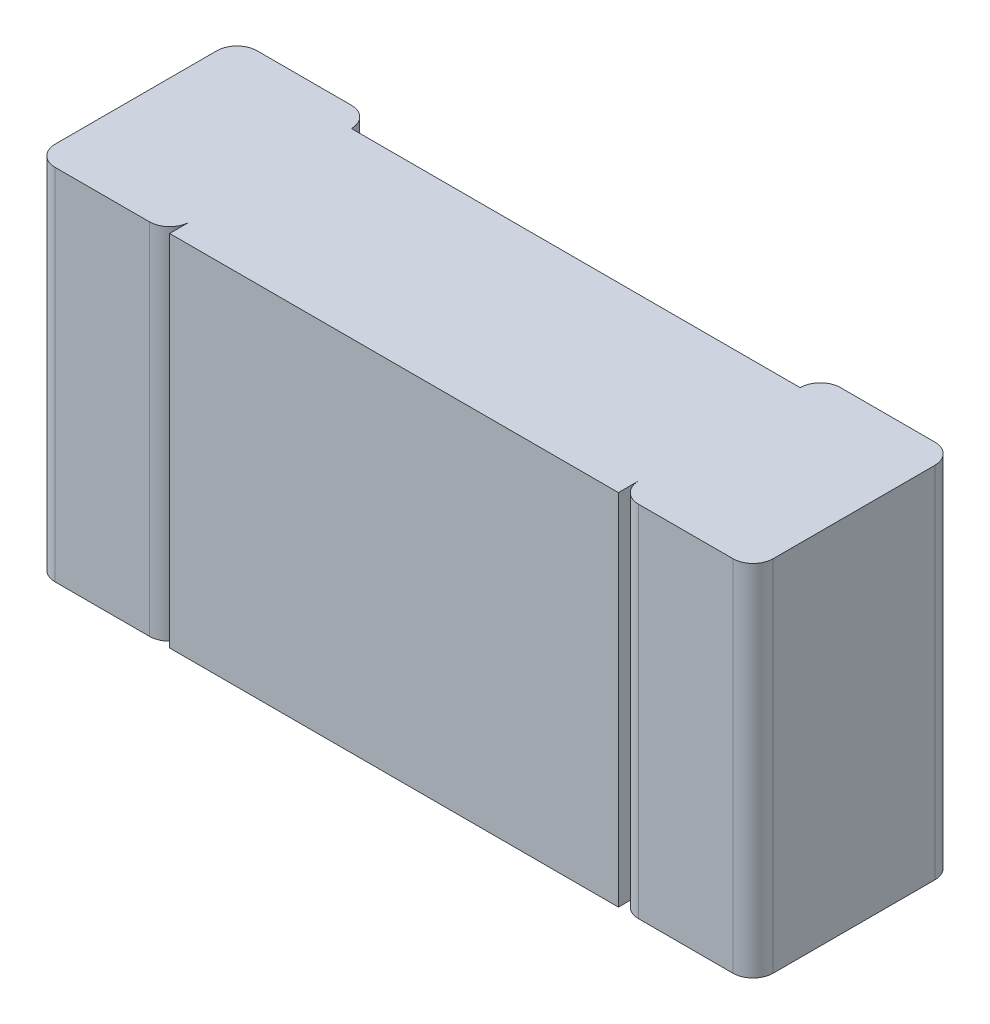
ISO-10303-21;
HEADER;
FILE_DESCRIPTION(('STEP AP214'),'2;1');
FILE_NAME('part.step','',(''),(''),'','','');
FILE_SCHEMA(('AUTOMOTIVE_DESIGN { 1 0 10303 214 1 1 1 1 }'));
ENDSEC;
DATA;
#1=APPLICATION_CONTEXT('core data for automotive mechanical design processes');
#2=APPLICATION_PROTOCOL_DEFINITION('international standard','automotive_design',2000,#1);
#3=PRODUCT_CONTEXT('',#1,'mechanical');
#4=PRODUCT('Part','Part','',(#3));
#5=PRODUCT_RELATED_PRODUCT_CATEGORY('part','',(#4));
#6=PRODUCT_DEFINITION_FORMATION('','',#4);
#7=PRODUCT_DEFINITION_CONTEXT('part definition',#1,'design');
#8=PRODUCT_DEFINITION('design','',#6,#7);
#9=PRODUCT_DEFINITION_SHAPE('','',#8);
#10=(LENGTH_UNIT() NAMED_UNIT(*) SI_UNIT(.MILLI.,.METRE.));
#11=(NAMED_UNIT(*) PLANE_ANGLE_UNIT() SI_UNIT($,.RADIAN.));
#12=(NAMED_UNIT(*) SI_UNIT($,.STERADIAN.) SOLID_ANGLE_UNIT());
#13=UNCERTAINTY_MEASURE_WITH_UNIT(LENGTH_MEASURE(1.E-05),#10,'distance_accuracy_value','');
#14=(GEOMETRIC_REPRESENTATION_CONTEXT(3) GLOBAL_UNCERTAINTY_ASSIGNED_CONTEXT((#13)) GLOBAL_UNIT_ASSIGNED_CONTEXT((#10,
#11,#12)) REPRESENTATION_CONTEXT('',''));
#15=CARTESIAN_POINT('',(0.,0.,0.));
#16=DIRECTION('',(0.,0.,1.));
#17=DIRECTION('',(1.,0.,0.));
#18=AXIS2_PLACEMENT_3D('',#15,#16,#17);
#19=CARTESIAN_POINT('',(-0.755,-0.4,0.045));
#20=DIRECTION('',(0.,1.,0.));
#21=DIRECTION('',(0.,0.,1.));
#22=AXIS2_PLACEMENT_3D('',#19,#20,#21);
#23=CYLINDRICAL_SURFACE('',#22,0.045);
#24=DIRECTION('',(0.,1.,0.));
#25=VECTOR('',#24,1.);
#26=CARTESIAN_POINT('',(-0.755,-0.4,0.));
#27=LINE('',#26,#25);
#28=CARTESIAN_POINT('',(-0.755,0.4,0.));
#29=VERTEX_POINT('',#28);
#30=CARTESIAN_POINT('',(-0.755,-0.4,0.));
#31=VERTEX_POINT('',#30);
#32=EDGE_CURVE('E129',#29,#31,#27,.F.);
#33=ORIENTED_EDGE('',*,*,#32,.T.);
#34=CARTESIAN_POINT('',(-0.755,-0.4,0.045));
#35=DIRECTION('',(0.,1.,0.));
#36=DIRECTION('',(0.,0.,1.));
#37=AXIS2_PLACEMENT_3D('',#34,#35,#36);
#38=CIRCLE('',#37,0.045);
#39=CARTESIAN_POINT('',(-0.8,-0.4,0.045));
#40=VERTEX_POINT('',#39);
#41=EDGE_CURVE('E20',#31,#40,#38,.T.);
#42=ORIENTED_EDGE('',*,*,#41,.T.);
#43=DIRECTION('',(0.,1.,0.));
#44=VECTOR('',#43,1.);
#45=CARTESIAN_POINT('',(-0.8,-0.4,0.045));
#46=LINE('',#45,#44);
#47=CARTESIAN_POINT('',(-0.8,0.4,0.045));
#48=VERTEX_POINT('',#47);
#49=EDGE_CURVE('E136',#40,#48,#46,.T.);
#50=ORIENTED_EDGE('',*,*,#49,.T.);
#51=CARTESIAN_POINT('',(-0.755,0.4,0.045));
#52=DIRECTION('',(0.,1.,0.));
#53=DIRECTION('',(0.,0.,1.));
#54=AXIS2_PLACEMENT_3D('',#51,#52,#53);
#55=CIRCLE('',#54,0.045);
#56=EDGE_CURVE('E232',#29,#48,#55,.T.);
#57=ORIENTED_EDGE('',*,*,#56,.F.);
#58=EDGE_LOOP('',(#33,#42,#50,#57));
#59=FACE_BOUND('',#58,.T.);
#60=ADVANCED_FACE('F17',(#59),#23,.T.);
#61=CARTESIAN_POINT('',(-0.8,-0.4,0.));
#62=DIRECTION('',(1.,0.,0.));
#63=DIRECTION('',(0.,0.,-1.));
#64=AXIS2_PLACEMENT_3D('',#61,#62,#63);
#65=PLANE('',#64);
#66=DIRECTION('',(0.,0.,1.));
#67=VECTOR('',#66,1.);
#68=CARTESIAN_POINT('',(-0.8,0.4,0.));
#69=LINE('',#68,#67);
#70=CARTESIAN_POINT('',(-0.8,0.4,0.405));
#71=VERTEX_POINT('',#70);
#72=EDGE_CURVE('E141',#48,#71,#69,.T.);
#73=ORIENTED_EDGE('',*,*,#72,.F.);
#74=ORIENTED_EDGE('',*,*,#49,.F.);
#75=DIRECTION('',(0.,0.,1.));
#76=VECTOR('',#75,1.);
#77=CARTESIAN_POINT('',(-0.8,-0.4,0.));
#78=LINE('',#77,#76);
#79=CARTESIAN_POINT('',(-0.8,-0.4,0.405));
#80=VERTEX_POINT('',#79);
#81=EDGE_CURVE('E140',#40,#80,#78,.T.);
#82=ORIENTED_EDGE('',*,*,#81,.T.);
#83=DIRECTION('',(0.,1.,0.));
#84=VECTOR('',#83,1.);
#85=CARTESIAN_POINT('',(-0.8,-0.4,0.405));
#86=LINE('',#85,#84);
#87=EDGE_CURVE('E142',#71,#80,#86,.F.);
#88=ORIENTED_EDGE('',*,*,#87,.F.);
#89=EDGE_LOOP('',(#73,#74,#82,#88));
#90=FACE_BOUND('',#89,.T.);
#91=ADVANCED_FACE('F138',(#90),#65,.F.);
#92=CARTESIAN_POINT('',(-0.755,-0.4,0.405));
#93=DIRECTION('',(0.,1.,0.));
#94=DIRECTION('',(0.,0.,1.));
#95=AXIS2_PLACEMENT_3D('',#92,#93,#94);
#96=CYLINDRICAL_SURFACE('',#95,0.045);
#97=CARTESIAN_POINT('',(-0.755,0.4,0.405));
#98=DIRECTION('',(0.,1.,0.));
#99=DIRECTION('',(0.,0.,1.));
#100=AXIS2_PLACEMENT_3D('',#97,#98,#99);
#101=CIRCLE('',#100,0.045);
#102=CARTESIAN_POINT('',(-0.755,0.4,0.45));
#103=VERTEX_POINT('',#102);
#104=EDGE_CURVE('E230',#71,#103,#101,.T.);
#105=ORIENTED_EDGE('',*,*,#104,.F.);
#106=ORIENTED_EDGE('',*,*,#87,.T.);
#107=CARTESIAN_POINT('',(-0.755,-0.4,0.405));
#108=DIRECTION('',(0.,1.,0.));
#109=DIRECTION('',(0.,0.,1.));
#110=AXIS2_PLACEMENT_3D('',#107,#108,#109);
#111=CIRCLE('',#110,0.045);
#112=CARTESIAN_POINT('',(-0.755,-0.4,0.45));
#113=VERTEX_POINT('',#112);
#114=EDGE_CURVE('E151',#80,#113,#111,.T.);
#115=ORIENTED_EDGE('',*,*,#114,.T.);
#116=DIRECTION('',(0.,1.,0.));
#117=VECTOR('',#116,1.);
#118=CARTESIAN_POINT('',(-0.755,-0.4,0.45));
#119=LINE('',#118,#117);
#120=EDGE_CURVE('E200',#103,#113,#119,.F.);
#121=ORIENTED_EDGE('',*,*,#120,.F.);
#122=EDGE_LOOP('',(#105,#106,#115,#121));
#123=FACE_BOUND('',#122,.T.);
#124=ADVANCED_FACE('F456',(#123),#96,.T.);
#125=CARTESIAN_POINT('',(-0.8,-0.4,0.45));
#126=DIRECTION('',(0.,0.,1.));
#127=DIRECTION('',(1.,0.,0.));
#128=AXIS2_PLACEMENT_3D('',#125,#126,#127);
#129=PLANE('',#128);
#130=DIRECTION('',(1.,0.,0.));
#131=VECTOR('',#130,1.);
#132=CARTESIAN_POINT('',(-0.8,-0.4,0.45));
#133=LINE('',#132,#131);
#134=CARTESIAN_POINT('',(-0.545,-0.4,0.45));
#135=VERTEX_POINT('',#134);
#136=EDGE_CURVE('E248',#113,#135,#133,.T.);
#137=ORIENTED_EDGE('',*,*,#136,.T.);
#138=DIRECTION('',(0.,1.,0.));
#139=VECTOR('',#138,1.);
#140=CARTESIAN_POINT('',(-0.545,-0.4,0.45));
#141=LINE('',#140,#139);
#142=CARTESIAN_POINT('',(-0.545,0.4,0.45));
#143=VERTEX_POINT('',#142);
#144=EDGE_CURVE('E198',#143,#135,#141,.F.);
#145=ORIENTED_EDGE('',*,*,#144,.F.);
#146=DIRECTION('',(1.,0.,0.));
#147=VECTOR('',#146,1.);
#148=CARTESIAN_POINT('',(-0.8,0.4,0.45));
#149=LINE('',#148,#147);
#150=EDGE_CURVE('E229',#103,#143,#149,.T.);
#151=ORIENTED_EDGE('',*,*,#150,.F.);
#152=ORIENTED_EDGE('',*,*,#120,.T.);
#153=EDGE_LOOP('',(#137,#145,#151,#152));
#154=FACE_BOUND('',#153,.T.);
#155=ADVANCED_FACE('F446',(#154),#129,.T.);
#156=CARTESIAN_POINT('',(-0.545,-0.4,0.405));
#157=DIRECTION('',(0.,1.,0.));
#158=DIRECTION('',(0.,0.,1.));
#159=AXIS2_PLACEMENT_3D('',#156,#157,#158);
#160=CYLINDRICAL_SURFACE('',#159,0.045);
#161=ORIENTED_EDGE('',*,*,#144,.T.);
#162=CARTESIAN_POINT('',(-0.545,-0.4,0.405));
#163=DIRECTION('',(0.,1.,0.));
#164=DIRECTION('',(0.,0.,1.));
#165=AXIS2_PLACEMENT_3D('',#162,#163,#164);
#166=CIRCLE('',#165,0.045);
#167=CARTESIAN_POINT('',(-0.5,-0.4,0.405));
#168=VERTEX_POINT('',#167);
#169=EDGE_CURVE('E246',#135,#168,#166,.T.);
#170=ORIENTED_EDGE('',*,*,#169,.T.);
#171=DIRECTION('',(0.,1.,0.));
#172=VECTOR('',#171,1.);
#173=CARTESIAN_POINT('',(-0.5,-0.4,0.405));
#174=LINE('',#173,#172);
#175=CARTESIAN_POINT('',(-0.5,0.4,0.405));
#176=VERTEX_POINT('',#175);
#177=EDGE_CURVE('E193',#168,#176,#174,.T.);
#178=ORIENTED_EDGE('',*,*,#177,.T.);
#179=CARTESIAN_POINT('',(-0.545,0.4,0.405));
#180=DIRECTION('',(0.,1.,0.));
#181=DIRECTION('',(0.,0.,1.));
#182=AXIS2_PLACEMENT_3D('',#179,#180,#181);
#183=CIRCLE('',#182,0.045);
#184=EDGE_CURVE('E227',#143,#176,#183,.T.);
#185=ORIENTED_EDGE('',*,*,#184,.F.);
#186=EDGE_LOOP('',(#161,#170,#178,#185));
#187=FACE_BOUND('',#186,.T.);
#188=ADVANCED_FACE('F434',(#187),#160,.T.);
#189=CARTESIAN_POINT('',(-0.5,-0.4,0.405));
#190=DIRECTION('',(1.,0.,0.));
#191=DIRECTION('',(0.,0.,-1.));
#192=AXIS2_PLACEMENT_3D('',#189,#190,#191);
#193=PLANE('',#192);
#194=DIRECTION('',(0.,0.,1.));
#195=VECTOR('',#194,1.);
#196=CARTESIAN_POINT('',(-0.5,0.4,0.405));
#197=LINE('',#196,#195);
#198=CARTESIAN_POINT('',(-0.5,0.4,0.45));
#199=VERTEX_POINT('',#198);
#200=EDGE_CURVE('E188',#176,#199,#197,.T.);
#201=ORIENTED_EDGE('',*,*,#200,.F.);
#202=ORIENTED_EDGE('',*,*,#177,.F.);
#203=DIRECTION('',(0.,0.,1.));
#204=VECTOR('',#203,1.);
#205=CARTESIAN_POINT('',(-0.5,-0.4,0.405));
#206=LINE('',#205,#204);
#207=CARTESIAN_POINT('',(-0.5,-0.4,0.45));
#208=VERTEX_POINT('',#207);
#209=EDGE_CURVE('E206',#168,#208,#206,.T.);
#210=ORIENTED_EDGE('',*,*,#209,.T.);
#211=DIRECTION('',(0.,1.,0.));
#212=VECTOR('',#211,1.);
#213=CARTESIAN_POINT('',(-0.5,-0.4,0.45));
#214=LINE('',#213,#212);
#215=EDGE_CURVE('E181',#199,#208,#214,.F.);
#216=ORIENTED_EDGE('',*,*,#215,.F.);
#217=EDGE_LOOP('',(#201,#202,#210,#216));
#218=FACE_BOUND('',#217,.T.);
#219=ADVANCED_FACE('F424',(#218),#193,.F.);
#220=CARTESIAN_POINT('',(-0.5,-0.4,0.45));
#221=DIRECTION('',(0.,0.,1.));
#222=DIRECTION('',(1.,0.,0.));
#223=AXIS2_PLACEMENT_3D('',#220,#221,#222);
#224=PLANE('',#223);
#225=DIRECTION('',(0.,1.,0.));
#226=VECTOR('',#225,1.);
#227=CARTESIAN_POINT('',(0.5,-0.4,0.45));
#228=LINE('',#227,#226);
#229=CARTESIAN_POINT('',(0.5,0.4,0.45));
#230=VERTEX_POINT('',#229);
#231=CARTESIAN_POINT('',(0.5,-0.4,0.45));
#232=VERTEX_POINT('',#231);
#233=EDGE_CURVE('E174',#230,#232,#228,.F.);
#234=ORIENTED_EDGE('',*,*,#233,.F.);
#235=DIRECTION('',(1.,0.,0.));
#236=VECTOR('',#235,1.);
#237=CARTESIAN_POINT('',(-0.5,0.4,0.45));
#238=LINE('',#237,#236);
#239=EDGE_CURVE('E184',#199,#230,#238,.T.);
#240=ORIENTED_EDGE('',*,*,#239,.F.);
#241=ORIENTED_EDGE('',*,*,#215,.T.);
#242=DIRECTION('',(1.,0.,0.));
#243=VECTOR('',#242,1.);
#244=CARTESIAN_POINT('',(-0.5,-0.4,0.45));
#245=LINE('',#244,#243);
#246=EDGE_CURVE('E203',#208,#232,#245,.T.);
#247=ORIENTED_EDGE('',*,*,#246,.T.);
#248=EDGE_LOOP('',(#234,#240,#241,#247));
#249=FACE_BOUND('',#248,.T.);
#250=ADVANCED_FACE('F411',(#249),#224,.T.);
#251=CARTESIAN_POINT('',(0.5,-0.4,0.405));
#252=DIRECTION('',(1.,0.,0.));
#253=DIRECTION('',(0.,0.,-1.));
#254=AXIS2_PLACEMENT_3D('',#251,#252,#253);
#255=PLANE('',#254);
#256=DIRECTION('',(0.,0.,1.));
#257=VECTOR('',#256,1.);
#258=CARTESIAN_POINT('',(0.5,0.4,0.405));
#259=LINE('',#258,#257);
#260=CARTESIAN_POINT('',(0.5,0.4,0.405));
#261=VERTEX_POINT('',#260);
#262=EDGE_CURVE('E187',#230,#261,#259,.F.);
#263=ORIENTED_EDGE('',*,*,#262,.F.);
#264=ORIENTED_EDGE('',*,*,#233,.T.);
#265=DIRECTION('',(0.,0.,1.));
#266=VECTOR('',#265,1.);
#267=CARTESIAN_POINT('',(0.5,-0.4,0.405));
#268=LINE('',#267,#266);
#269=CARTESIAN_POINT('',(0.5,-0.4,0.405));
#270=VERTEX_POINT('',#269);
#271=EDGE_CURVE('E178',#232,#270,#268,.F.);
#272=ORIENTED_EDGE('',*,*,#271,.T.);
#273=DIRECTION('',(0.,1.,0.));
#274=VECTOR('',#273,1.);
#275=CARTESIAN_POINT('',(0.5,-0.4,0.405));
#276=LINE('',#275,#274);
#277=EDGE_CURVE('E172',#261,#270,#276,.F.);
#278=ORIENTED_EDGE('',*,*,#277,.F.);
#279=EDGE_LOOP('',(#263,#264,#272,#278));
#280=FACE_BOUND('',#279,.T.);
#281=ADVANCED_FACE('F375',(#280),#255,.T.);
#282=CARTESIAN_POINT('',(0.545,-0.4,0.405));
#283=DIRECTION('',(0.,1.,0.));
#284=DIRECTION('',(0.,0.,1.));
#285=AXIS2_PLACEMENT_3D('',#282,#283,#284);
#286=CYLINDRICAL_SURFACE('',#285,0.045);
#287=CARTESIAN_POINT('',(0.545,0.4,0.405));
#288=DIRECTION('',(0.,1.,0.));
#289=DIRECTION('',(0.,0.,1.));
#290=AXIS2_PLACEMENT_3D('',#287,#288,#289);
#291=CIRCLE('',#290,0.045);
#292=CARTESIAN_POINT('',(0.545,0.4,0.45));
#293=VERTEX_POINT('',#292);
#294=EDGE_CURVE('E224',#261,#293,#291,.T.);
#295=ORIENTED_EDGE('',*,*,#294,.F.);
#296=ORIENTED_EDGE('',*,*,#277,.T.);
#297=CARTESIAN_POINT('',(0.545,-0.4,0.405));
#298=DIRECTION('',(0.,1.,0.));
#299=DIRECTION('',(0.,0.,1.));
#300=AXIS2_PLACEMENT_3D('',#297,#298,#299);
#301=CIRCLE('',#300,0.045);
#302=CARTESIAN_POINT('',(0.545,-0.4,0.45));
#303=VERTEX_POINT('',#302);
#304=EDGE_CURVE('E243',#270,#303,#301,.T.);
#305=ORIENTED_EDGE('',*,*,#304,.T.);
#306=DIRECTION('',(0.,1.,0.));
#307=VECTOR('',#306,1.);
#308=CARTESIAN_POINT('',(0.545,-0.4,0.45));
#309=LINE('',#308,#307);
#310=EDGE_CURVE('E170',#293,#303,#309,.F.);
#311=ORIENTED_EDGE('',*,*,#310,.F.);
#312=EDGE_LOOP('',(#295,#296,#305,#311));
#313=FACE_BOUND('',#312,.T.);
#314=ADVANCED_FACE('F410',(#313),#286,.T.);
#315=CARTESIAN_POINT('',(0.5,-0.4,0.45));
#316=DIRECTION('',(0.,0.,1.));
#317=DIRECTION('',(1.,0.,0.));
#318=AXIS2_PLACEMENT_3D('',#315,#316,#317);
#319=PLANE('',#318);
#320=DIRECTION('',(1.,0.,0.));
#321=VECTOR('',#320,1.);
#322=CARTESIAN_POINT('',(0.5,-0.4,0.45));
#323=LINE('',#322,#321);
#324=CARTESIAN_POINT('',(0.755,-0.4,0.45));
#325=VERTEX_POINT('',#324);
#326=EDGE_CURVE('E242',#303,#325,#323,.T.);
#327=ORIENTED_EDGE('',*,*,#326,.T.);
#328=DIRECTION('',(0.,1.,0.));
#329=VECTOR('',#328,1.);
#330=CARTESIAN_POINT('',(0.755,-0.4,0.45));
#331=LINE('',#330,#329);
#332=CARTESIAN_POINT('',(0.755,0.4,0.45));
#333=VERTEX_POINT('',#332);
#334=EDGE_CURVE('E168',#333,#325,#331,.F.);
#335=ORIENTED_EDGE('',*,*,#334,.F.);
#336=DIRECTION('',(1.,0.,0.));
#337=VECTOR('',#336,1.);
#338=CARTESIAN_POINT('',(0.5,0.4,0.45));
#339=LINE('',#338,#337);
#340=EDGE_CURVE('E223',#293,#333,#339,.T.);
#341=ORIENTED_EDGE('',*,*,#340,.F.);
#342=ORIENTED_EDGE('',*,*,#310,.T.);
#343=EDGE_LOOP('',(#327,#335,#341,#342));
#344=FACE_BOUND('',#343,.T.);
#345=ADVANCED_FACE('F487',(#344),#319,.T.);
#346=CARTESIAN_POINT('',(0.755,-0.4,0.405));
#347=DIRECTION('',(0.,1.,0.));
#348=DIRECTION('',(0.,0.,1.));
#349=AXIS2_PLACEMENT_3D('',#346,#347,#348);
#350=CYLINDRICAL_SURFACE('',#349,0.045);
#351=ORIENTED_EDGE('',*,*,#334,.T.);
#352=CARTESIAN_POINT('',(0.755,-0.4,0.405));
#353=DIRECTION('',(0.,1.,0.));
#354=DIRECTION('',(0.,0.,1.));
#355=AXIS2_PLACEMENT_3D('',#352,#353,#354);
#356=CIRCLE('',#355,0.045);
#357=CARTESIAN_POINT('',(0.8,-0.4,0.405));
#358=VERTEX_POINT('',#357);
#359=EDGE_CURVE('E239',#325,#358,#356,.T.);
#360=ORIENTED_EDGE('',*,*,#359,.T.);
#361=DIRECTION('',(0.,1.,0.));
#362=VECTOR('',#361,1.);
#363=CARTESIAN_POINT('',(0.8,-0.4,0.405));
#364=LINE('',#363,#362);
#365=CARTESIAN_POINT('',(0.8,0.4,0.405));
#366=VERTEX_POINT('',#365);
#367=EDGE_CURVE('E166',#366,#358,#364,.F.);
#368=ORIENTED_EDGE('',*,*,#367,.F.);
#369=CARTESIAN_POINT('',(0.755,0.4,0.405));
#370=DIRECTION('',(0.,1.,0.));
#371=DIRECTION('',(0.,0.,1.));
#372=AXIS2_PLACEMENT_3D('',#369,#370,#371);
#373=CIRCLE('',#372,0.045);
#374=EDGE_CURVE('E221',#333,#366,#373,.T.);
#375=ORIENTED_EDGE('',*,*,#374,.F.);
#376=EDGE_LOOP('',(#351,#360,#368,#375));
#377=FACE_BOUND('',#376,.T.);
#378=ADVANCED_FACE('F491',(#377),#350,.T.);
#379=CARTESIAN_POINT('',(0.8,-0.4,0.));
#380=DIRECTION('',(1.,0.,0.));
#381=DIRECTION('',(0.,0.,-1.));
#382=AXIS2_PLACEMENT_3D('',#379,#380,#381);
#383=PLANE('',#382);
#384=DIRECTION('',(0.,0.,1.));
#385=VECTOR('',#384,1.);
#386=CARTESIAN_POINT('',(0.8,0.4,0.));
#387=LINE('',#386,#385);
#388=CARTESIAN_POINT('',(0.8,0.4,0.045));
#389=VERTEX_POINT('',#388);
#390=EDGE_CURVE('E220',#366,#389,#387,.F.);
#391=ORIENTED_EDGE('',*,*,#390,.F.);
#392=ORIENTED_EDGE('',*,*,#367,.T.);
#393=DIRECTION('',(0.,0.,1.));
#394=VECTOR('',#393,1.);
#395=CARTESIAN_POINT('',(0.8,-0.4,0.));
#396=LINE('',#395,#394);
#397=CARTESIAN_POINT('',(0.8,-0.4,0.045));
#398=VERTEX_POINT('',#397);
#399=EDGE_CURVE('E238',#358,#398,#396,.F.);
#400=ORIENTED_EDGE('',*,*,#399,.T.);
#401=DIRECTION('',(0.,1.,0.));
#402=VECTOR('',#401,1.);
#403=CARTESIAN_POINT('',(0.8,-0.4,0.045));
#404=LINE('',#403,#402);
#405=EDGE_CURVE('E157',#389,#398,#404,.F.);
#406=ORIENTED_EDGE('',*,*,#405,.F.);
#407=EDGE_LOOP('',(#391,#392,#400,#406));
#408=FACE_BOUND('',#407,.T.);
#409=ADVANCED_FACE('F298',(#408),#383,.T.);
#410=CARTESIAN_POINT('',(0.755,-0.4,0.045));
#411=DIRECTION('',(0.,1.,0.));
#412=DIRECTION('',(0.,0.,1.));
#413=AXIS2_PLACEMENT_3D('',#410,#411,#412);
#414=CYLINDRICAL_SURFACE('',#413,0.045);
#415=CARTESIAN_POINT('',(0.755,0.4,0.045));
#416=DIRECTION('',(0.,1.,0.));
#417=DIRECTION('',(0.,0.,1.));
#418=AXIS2_PLACEMENT_3D('',#415,#416,#417);
#419=CIRCLE('',#418,0.045);
#420=CARTESIAN_POINT('',(0.755,0.4,0.));
#421=VERTEX_POINT('',#420);
#422=EDGE_CURVE('E217',#389,#421,#419,.T.);
#423=ORIENTED_EDGE('',*,*,#422,.F.);
#424=ORIENTED_EDGE('',*,*,#405,.T.);
#425=CARTESIAN_POINT('',(0.755,-0.4,0.045));
#426=DIRECTION('',(0.,1.,0.));
#427=DIRECTION('',(0.,0.,1.));
#428=AXIS2_PLACEMENT_3D('',#425,#426,#427);
#429=CIRCLE('',#428,0.045);
#430=CARTESIAN_POINT('',(0.755,-0.4,0.));
#431=VERTEX_POINT('',#430);
#432=EDGE_CURVE('E235',#398,#431,#429,.T.);
#433=ORIENTED_EDGE('',*,*,#432,.T.);
#434=DIRECTION('',(0.,1.,0.));
#435=VECTOR('',#434,1.);
#436=CARTESIAN_POINT('',(0.755,-0.4,0.));
#437=LINE('',#436,#435);
#438=EDGE_CURVE('E175',#431,#421,#437,.T.);
#439=ORIENTED_EDGE('',*,*,#438,.T.);
#440=EDGE_LOOP('',(#423,#424,#433,#439));
#441=FACE_BOUND('',#440,.T.);
#442=ADVANCED_FACE('F302',(#441),#414,.T.);
#443=CARTESIAN_POINT('',(-0.8,-0.4,0.));
#444=DIRECTION('',(0.,0.,1.));
#445=DIRECTION('',(1.,0.,0.));
#446=AXIS2_PLACEMENT_3D('',#443,#444,#445);
#447=PLANE('',#446);
#448=DIRECTION('',(1.,0.,0.));
#449=VECTOR('',#448,1.);
#450=CARTESIAN_POINT('',(-0.8,-0.4,0.));
#451=LINE('',#450,#449);
#452=CARTESIAN_POINT('',(-0.545,-0.4,0.));
#453=VERTEX_POINT('',#452);
#454=EDGE_CURVE('E153',#453,#31,#451,.F.);
#455=ORIENTED_EDGE('',*,*,#454,.T.);
#456=ORIENTED_EDGE('',*,*,#32,.F.);
#457=DIRECTION('',(1.,0.,0.));
#458=VECTOR('',#457,1.);
#459=CARTESIAN_POINT('',(-0.8,0.4,0.));
#460=LINE('',#459,#458);
#461=CARTESIAN_POINT('',(-0.545,0.4,0.));
#462=VERTEX_POINT('',#461);
#463=EDGE_CURVE('E234',#462,#29,#460,.F.);
#464=ORIENTED_EDGE('',*,*,#463,.F.);
#465=DIRECTION('',(0.,1.,0.));
#466=VECTOR('',#465,1.);
#467=CARTESIAN_POINT('',(-0.545,-0.4,0.));
#468=LINE('',#467,#466);
#469=EDGE_CURVE('E161',#453,#462,#468,.T.);
#470=ORIENTED_EDGE('',*,*,#469,.F.);
#471=EDGE_LOOP('',(#455,#456,#464,#470));
#472=FACE_BOUND('',#471,.T.);
#473=ADVANCED_FACE('F319',(#472),#447,.F.);
#474=CARTESIAN_POINT('',(0.5,-0.4,0.));
#475=DIRECTION('',(0.,0.,1.));
#476=DIRECTION('',(1.,0.,0.));
#477=AXIS2_PLACEMENT_3D('',#474,#475,#476);
#478=PLANE('',#477);
#479=DIRECTION('',(1.,0.,0.));
#480=VECTOR('',#479,1.);
#481=CARTESIAN_POINT('',(0.5,-0.4,0.));
#482=LINE('',#481,#480);
#483=CARTESIAN_POINT('',(0.545,-0.4,0.));
#484=VERTEX_POINT('',#483);
#485=EDGE_CURVE('E177',#431,#484,#482,.F.);
#486=ORIENTED_EDGE('',*,*,#485,.T.);
#487=DIRECTION('',(0.,1.,0.));
#488=VECTOR('',#487,1.);
#489=CARTESIAN_POINT('',(0.545,-0.4,0.));
#490=LINE('',#489,#488);
#491=CARTESIAN_POINT('',(0.545,0.4,0.));
#492=VERTEX_POINT('',#491);
#493=EDGE_CURVE('E212',#492,#484,#490,.F.);
#494=ORIENTED_EDGE('',*,*,#493,.F.);
#495=DIRECTION('',(1.,0.,0.));
#496=VECTOR('',#495,1.);
#497=CARTESIAN_POINT('',(0.5,0.4,0.));
#498=LINE('',#497,#496);
#499=EDGE_CURVE('E226',#421,#492,#498,.F.);
#500=ORIENTED_EDGE('',*,*,#499,.F.);
#501=ORIENTED_EDGE('',*,*,#438,.F.);
#502=EDGE_LOOP('',(#486,#494,#500,#501));
#503=FACE_BOUND('',#502,.T.);
#504=ADVANCED_FACE('F305',(#503),#478,.F.);
#505=CARTESIAN_POINT('',(-0.545,-0.4,0.045));
#506=DIRECTION('',(0.,1.,0.));
#507=DIRECTION('',(0.,0.,1.));
#508=AXIS2_PLACEMENT_3D('',#505,#506,#507);
#509=CYLINDRICAL_SURFACE('',#508,0.045);
#510=CARTESIAN_POINT('',(-0.545,0.4,0.045));
#511=DIRECTION('',(0.,1.,0.));
#512=DIRECTION('',(0.,0.,1.));
#513=AXIS2_PLACEMENT_3D('',#510,#511,#512);
#514=CIRCLE('',#513,0.045);
#515=CARTESIAN_POINT('',(-0.5,0.4,0.045));
#516=VERTEX_POINT('',#515);
#517=EDGE_CURVE('E163',#462,#516,#514,.F.);
#518=ORIENTED_EDGE('',*,*,#517,.T.);
#519=DIRECTION('',(0.,1.,0.));
#520=VECTOR('',#519,1.);
#521=CARTESIAN_POINT('',(-0.5,-0.4,0.045));
#522=LINE('',#521,#520);
#523=CARTESIAN_POINT('',(-0.5,-0.4,0.045));
#524=VERTEX_POINT('',#523);
#525=EDGE_CURVE('E211',#516,#524,#522,.F.);
#526=ORIENTED_EDGE('',*,*,#525,.T.);
#527=CARTESIAN_POINT('',(-0.545,-0.4,0.045));
#528=DIRECTION('',(0.,1.,0.));
#529=DIRECTION('',(0.,0.,1.));
#530=AXIS2_PLACEMENT_3D('',#527,#528,#529);
#531=CIRCLE('',#530,0.045);
#532=EDGE_CURVE('E164',#524,#453,#531,.T.);
#533=ORIENTED_EDGE('',*,*,#532,.T.);
#534=ORIENTED_EDGE('',*,*,#469,.T.);
#535=EDGE_LOOP('',(#518,#526,#533,#534));
#536=FACE_BOUND('',#535,.T.);
#537=ADVANCED_FACE('F318',(#536),#509,.T.);
#538=CARTESIAN_POINT('',(-0.755,-0.4,0.045));
#539=DIRECTION('',(0.,1.,0.));
#540=DIRECTION('',(0.,0.,1.));
#541=AXIS2_PLACEMENT_3D('',#538,#539,#540);
#542=PLANE('',#541);
#543=DIRECTION('',(1.,0.,0.));
#544=VECTOR('',#543,1.);
#545=CARTESIAN_POINT('',(-0.755,-0.4,0.045));
#546=LINE('',#545,#544);
#547=CARTESIAN_POINT('',(0.5,-0.4,0.045));
#548=VERTEX_POINT('',#547);
#549=EDGE_CURVE('E263',#524,#548,#546,.T.);
#550=ORIENTED_EDGE('',*,*,#549,.T.);
#551=CARTESIAN_POINT('',(0.545,-0.4,0.045));
#552=DIRECTION('',(0.,1.,0.));
#553=DIRECTION('',(0.,0.,1.));
#554=AXIS2_PLACEMENT_3D('',#551,#552,#553);
#555=CIRCLE('',#554,0.045);
#556=EDGE_CURVE('E209',#484,#548,#555,.T.);
#557=ORIENTED_EDGE('',*,*,#556,.F.);
#558=ORIENTED_EDGE('',*,*,#485,.F.);
#559=ORIENTED_EDGE('',*,*,#432,.F.);
#560=ORIENTED_EDGE('',*,*,#399,.F.);
#561=ORIENTED_EDGE('',*,*,#359,.F.);
#562=ORIENTED_EDGE('',*,*,#326,.F.);
#563=ORIENTED_EDGE('',*,*,#304,.F.);
#564=ORIENTED_EDGE('',*,*,#271,.F.);
#565=ORIENTED_EDGE('',*,*,#246,.F.);
#566=ORIENTED_EDGE('',*,*,#209,.F.);
#567=ORIENTED_EDGE('',*,*,#169,.F.);
#568=ORIENTED_EDGE('',*,*,#136,.F.);
#569=ORIENTED_EDGE('',*,*,#114,.F.);
#570=ORIENTED_EDGE('',*,*,#81,.F.);
#571=ORIENTED_EDGE('',*,*,#41,.F.);
#572=ORIENTED_EDGE('',*,*,#454,.F.);
#573=ORIENTED_EDGE('',*,*,#532,.F.);
#574=EDGE_LOOP('',(#550,#557,#558,#559,#560,#561,#562,#563,#564,#565,#566,#567,#568,#569,#570,
#571,#572,#573));
#575=FACE_BOUND('',#574,.T.);
#576=ADVANCED_FACE('F147',(#575),#542,.F.);
#577=CARTESIAN_POINT('',(0.545,-0.4,0.045));
#578=DIRECTION('',(0.,1.,0.));
#579=DIRECTION('',(0.,0.,1.));
#580=AXIS2_PLACEMENT_3D('',#577,#578,#579);
#581=CYLINDRICAL_SURFACE('',#580,0.045);
#582=ORIENTED_EDGE('',*,*,#493,.T.);
#583=ORIENTED_EDGE('',*,*,#556,.T.);
#584=DIRECTION('',(0.,1.,0.));
#585=VECTOR('',#584,1.);
#586=CARTESIAN_POINT('',(0.5,-0.4,0.045));
#587=LINE('',#586,#585);
#588=CARTESIAN_POINT('',(0.5,0.4,0.045));
#589=VERTEX_POINT('',#588);
#590=EDGE_CURVE('E26',#548,#589,#587,.T.);
#591=ORIENTED_EDGE('',*,*,#590,.T.);
#592=CARTESIAN_POINT('',(0.545,0.4,0.045));
#593=DIRECTION('',(0.,1.,0.));
#594=DIRECTION('',(0.,0.,1.));
#595=AXIS2_PLACEMENT_3D('',#592,#593,#594);
#596=CIRCLE('',#595,0.045);
#597=EDGE_CURVE('E34',#589,#492,#596,.F.);
#598=ORIENTED_EDGE('',*,*,#597,.T.);
#599=EDGE_LOOP('',(#582,#583,#591,#598));
#600=FACE_BOUND('',#599,.T.);
#601=ADVANCED_FACE('F311',(#600),#581,.T.);
#602=CARTESIAN_POINT('',(-0.755,0.4,0.045));
#603=DIRECTION('',(0.,1.,0.));
#604=DIRECTION('',(0.,0.,1.));
#605=AXIS2_PLACEMENT_3D('',#602,#603,#604);
#606=PLANE('',#605);
#607=DIRECTION('',(1.,0.,0.));
#608=VECTOR('',#607,1.);
#609=CARTESIAN_POINT('',(-0.755,0.4,0.045));
#610=LINE('',#609,#608);
#611=EDGE_CURVE('E11',#589,#516,#610,.F.);
#612=ORIENTED_EDGE('',*,*,#611,.T.);
#613=ORIENTED_EDGE('',*,*,#517,.F.);
#614=ORIENTED_EDGE('',*,*,#463,.T.);
#615=ORIENTED_EDGE('',*,*,#56,.T.);
#616=ORIENTED_EDGE('',*,*,#72,.T.);
#617=ORIENTED_EDGE('',*,*,#104,.T.);
#618=ORIENTED_EDGE('',*,*,#150,.T.);
#619=ORIENTED_EDGE('',*,*,#184,.T.);
#620=ORIENTED_EDGE('',*,*,#200,.T.);
#621=ORIENTED_EDGE('',*,*,#239,.T.);
#622=ORIENTED_EDGE('',*,*,#262,.T.);
#623=ORIENTED_EDGE('',*,*,#294,.T.);
#624=ORIENTED_EDGE('',*,*,#340,.T.);
#625=ORIENTED_EDGE('',*,*,#374,.T.);
#626=ORIENTED_EDGE('',*,*,#390,.T.);
#627=ORIENTED_EDGE('',*,*,#422,.T.);
#628=ORIENTED_EDGE('',*,*,#499,.T.);
#629=ORIENTED_EDGE('',*,*,#597,.F.);
#630=EDGE_LOOP('',(#612,#613,#614,#615,#616,#617,#618,#619,#620,#621,#622,#623,#624,#625,#626,
#627,#628,#629));
#631=FACE_BOUND('',#630,.T.);
#632=ADVANCED_FACE('F292',(#631),#606,.T.);
#633=CARTESIAN_POINT('',(-0.755,-0.4,0.045));
#634=DIRECTION('',(0.,0.,1.));
#635=DIRECTION('',(1.,0.,0.));
#636=AXIS2_PLACEMENT_3D('',#633,#634,#635);
#637=PLANE('',#636);
#638=ORIENTED_EDGE('',*,*,#590,.F.);
#639=ORIENTED_EDGE('',*,*,#549,.F.);
#640=ORIENTED_EDGE('',*,*,#525,.F.);
#641=ORIENTED_EDGE('',*,*,#611,.F.);
#642=EDGE_LOOP('',(#638,#639,#640,#641));
#643=FACE_BOUND('',#642,.T.);
#644=ADVANCED_FACE('F313',(#643),#637,.F.);
#645=CLOSED_SHELL('',(#60,#91,#124,#155,#188,#219,#250,#281,#314,#345,#378,#409,#442,#473,#504,
#537,#576,#601,#632,#644));
#646=MANIFOLD_SOLID_BREP('B1',#645);
#647=ADVANCED_BREP_SHAPE_REPRESENTATION('',(#18,#646),#14);
#648=SHAPE_DEFINITION_REPRESENTATION(#9,#647);
ENDSEC;
END-ISO-10303-21;
